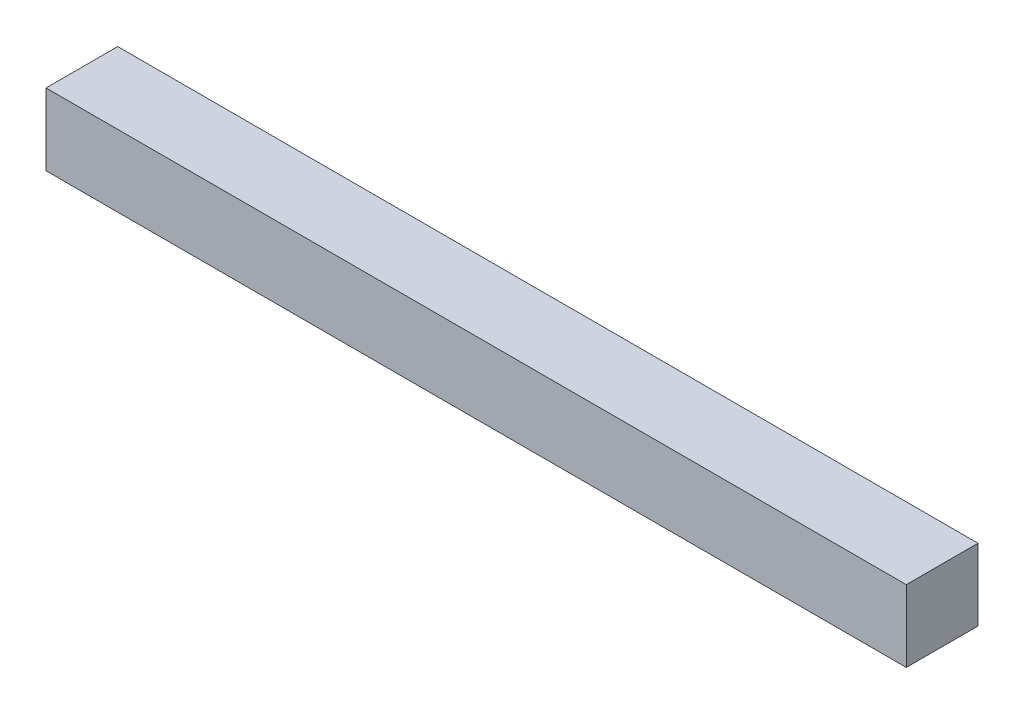
ISO-10303-21;
HEADER;
FILE_DESCRIPTION(('STEP AP214'),'2;1');
FILE_NAME('part.step','',(''),(''),'','','');
FILE_SCHEMA(('AUTOMOTIVE_DESIGN { 1 0 10303 214 1 1 1 1 }'));
ENDSEC;
DATA;
#1=APPLICATION_CONTEXT('core data for automotive mechanical design processes');
#2=APPLICATION_PROTOCOL_DEFINITION('international standard','automotive_design',2000,#1);
#3=PRODUCT_CONTEXT('',#1,'mechanical');
#4=PRODUCT('Part','Part','',(#3));
#5=PRODUCT_RELATED_PRODUCT_CATEGORY('part','',(#4));
#6=PRODUCT_DEFINITION_FORMATION('','',#4);
#7=PRODUCT_DEFINITION_CONTEXT('part definition',#1,'design');
#8=PRODUCT_DEFINITION('design','',#6,#7);
#9=PRODUCT_DEFINITION_SHAPE('','',#8);
#10=(LENGTH_UNIT() NAMED_UNIT(*) SI_UNIT(.MILLI.,.METRE.));
#11=(NAMED_UNIT(*) PLANE_ANGLE_UNIT() SI_UNIT($,.RADIAN.));
#12=(NAMED_UNIT(*) SI_UNIT($,.STERADIAN.) SOLID_ANGLE_UNIT());
#13=UNCERTAINTY_MEASURE_WITH_UNIT(LENGTH_MEASURE(1.E-05),#10,'distance_accuracy_value','');
#14=(GEOMETRIC_REPRESENTATION_CONTEXT(3) GLOBAL_UNCERTAINTY_ASSIGNED_CONTEXT((#13)) GLOBAL_UNIT_ASSIGNED_CONTEXT((#10,
#11,#12)) REPRESENTATION_CONTEXT('',''));
#15=CARTESIAN_POINT('',(0.,0.,0.));
#16=DIRECTION('',(0.,0.,1.));
#17=DIRECTION('',(1.,0.,0.));
#18=AXIS2_PLACEMENT_3D('',#15,#16,#17);
#19=CARTESIAN_POINT('',(1.025,1.65,3.2));
#20=DIRECTION('',(0.,0.,-1.));
#21=DIRECTION('',(-1.,0.,0.));
#22=AXIS2_PLACEMENT_3D('',#19,#20,#21);
#23=PLANE('',#22);
#24=DIRECTION('',(1.,0.,0.));
#25=VECTOR('',#24,1.);
#26=CARTESIAN_POINT('',(2.22473684210527,1.65,3.2));
#27=LINE('',#26,#25);
#28=CARTESIAN_POINT('',(1.025,1.65,3.2));
#29=VERTEX_POINT('',#28);
#30=CARTESIAN_POINT('',(2.22473684210527,1.65,3.2));
#31=VERTEX_POINT('',#30);
#32=EDGE_CURVE('E54',#29,#31,#27,.T.);
#33=ORIENTED_EDGE('',*,*,#32,.T.);
#34=DIRECTION('',(0.,1.,0.));
#35=VECTOR('',#34,1.);
#36=CARTESIAN_POINT('',(2.22473684210527,1.65,3.2));
#37=LINE('',#36,#35);
#38=CARTESIAN_POINT('',(2.22473684210527,1.55,3.2));
#39=VERTEX_POINT('',#38);
#40=EDGE_CURVE('E66',#39,#31,#37,.T.);
#41=ORIENTED_EDGE('',*,*,#40,.F.);
#42=DIRECTION('',(1.,0.,0.));
#43=VECTOR('',#42,1.);
#44=CARTESIAN_POINT('',(2.22473684210527,1.55,3.2));
#45=LINE('',#44,#43);
#46=CARTESIAN_POINT('',(1.025,1.55,3.2));
#47=VERTEX_POINT('',#46);
#48=EDGE_CURVE('E19',#47,#39,#45,.T.);
#49=ORIENTED_EDGE('',*,*,#48,.F.);
#50=DIRECTION('',(0.,1.,0.));
#51=VECTOR('',#50,1.);
#52=CARTESIAN_POINT('',(1.025,1.65,3.2));
#53=LINE('',#52,#51);
#54=EDGE_CURVE('E80',#29,#47,#53,.F.);
#55=ORIENTED_EDGE('',*,*,#54,.F.);
#56=EDGE_LOOP('',(#33,#41,#49,#55));
#57=FACE_BOUND('',#56,.T.);
#58=ADVANCED_FACE('F16',(#57),#23,.T.);
#59=CARTESIAN_POINT('',(2.22473684210527,1.55,3.3));
#60=DIRECTION('',(0.,-1.,0.));
#61=DIRECTION('',(0.,0.,-1.));
#62=AXIS2_PLACEMENT_3D('',#59,#60,#61);
#63=PLANE('',#62);
#64=DIRECTION('',(0.,0.,1.));
#65=VECTOR('',#64,1.);
#66=CARTESIAN_POINT('',(1.025,1.55,3.3));
#67=LINE('',#66,#65);
#68=CARTESIAN_POINT('',(1.025,1.55,3.3));
#69=VERTEX_POINT('',#68);
#70=EDGE_CURVE('E64',#47,#69,#67,.T.);
#71=ORIENTED_EDGE('',*,*,#70,.F.);
#72=ORIENTED_EDGE('',*,*,#48,.T.);
#73=DIRECTION('',(0.,0.,-1.));
#74=VECTOR('',#73,1.);
#75=CARTESIAN_POINT('',(2.22473684210527,1.55,3.2));
#76=LINE('',#75,#74);
#77=CARTESIAN_POINT('',(2.22473684210527,1.55,3.3));
#78=VERTEX_POINT('',#77);
#79=EDGE_CURVE('E61',#78,#39,#76,.T.);
#80=ORIENTED_EDGE('',*,*,#79,.F.);
#81=DIRECTION('',(1.,0.,0.));
#82=VECTOR('',#81,1.);
#83=CARTESIAN_POINT('',(2.22473684210527,1.55,3.3));
#84=LINE('',#83,#82);
#85=EDGE_CURVE('E82',#69,#78,#84,.T.);
#86=ORIENTED_EDGE('',*,*,#85,.F.);
#87=EDGE_LOOP('',(#71,#72,#80,#86));
#88=FACE_BOUND('',#87,.T.);
#89=ADVANCED_FACE('F59',(#88),#63,.T.);
#90=CARTESIAN_POINT('',(2.22473684210527,1.65,3.2));
#91=DIRECTION('',(1.,0.,0.));
#92=DIRECTION('',(0.,0.,-1.));
#93=AXIS2_PLACEMENT_3D('',#90,#91,#92);
#94=PLANE('',#93);
#95=DIRECTION('',(0.,0.,-1.));
#96=VECTOR('',#95,1.);
#97=CARTESIAN_POINT('',(2.22473684210527,1.65,3.3));
#98=LINE('',#97,#96);
#99=CARTESIAN_POINT('',(2.22473684210527,1.65,3.3));
#100=VERTEX_POINT('',#99);
#101=EDGE_CURVE('E76',#31,#100,#98,.F.);
#102=ORIENTED_EDGE('',*,*,#101,.T.);
#103=DIRECTION('',(0.,1.,0.));
#104=VECTOR('',#103,1.);
#105=CARTESIAN_POINT('',(2.22473684210527,1.65,3.3));
#106=LINE('',#105,#104);
#107=EDGE_CURVE('E72',#78,#100,#106,.T.);
#108=ORIENTED_EDGE('',*,*,#107,.F.);
#109=ORIENTED_EDGE('',*,*,#79,.T.);
#110=ORIENTED_EDGE('',*,*,#40,.T.);
#111=EDGE_LOOP('',(#102,#108,#109,#110));
#112=FACE_BOUND('',#111,.T.);
#113=ADVANCED_FACE('F70',(#112),#94,.T.);
#114=CARTESIAN_POINT('',(2.22473684210527,1.65,3.3));
#115=DIRECTION('',(0.,-1.,0.));
#116=DIRECTION('',(0.,0.,-1.));
#117=AXIS2_PLACEMENT_3D('',#114,#115,#116);
#118=PLANE('',#117);
#119=ORIENTED_EDGE('',*,*,#32,.F.);
#120=DIRECTION('',(0.,0.,1.));
#121=VECTOR('',#120,1.);
#122=CARTESIAN_POINT('',(1.025,1.65,3.3));
#123=LINE('',#122,#121);
#124=CARTESIAN_POINT('',(1.025,1.65,3.3));
#125=VERTEX_POINT('',#124);
#126=EDGE_CURVE('E34',#125,#29,#123,.F.);
#127=ORIENTED_EDGE('',*,*,#126,.F.);
#128=DIRECTION('',(1.,0.,0.));
#129=VECTOR('',#128,1.);
#130=CARTESIAN_POINT('',(2.22473684210527,1.65,3.3));
#131=LINE('',#130,#129);
#132=EDGE_CURVE('E25',#100,#125,#131,.F.);
#133=ORIENTED_EDGE('',*,*,#132,.F.);
#134=ORIENTED_EDGE('',*,*,#101,.F.);
#135=EDGE_LOOP('',(#119,#127,#133,#134));
#136=FACE_BOUND('',#135,.T.);
#137=ADVANCED_FACE('F88',(#136),#118,.F.);
#138=CARTESIAN_POINT('',(1.025,1.65,3.3));
#139=DIRECTION('',(-1.,0.,0.));
#140=DIRECTION('',(0.,0.,1.));
#141=AXIS2_PLACEMENT_3D('',#138,#139,#140);
#142=PLANE('',#141);
#143=ORIENTED_EDGE('',*,*,#126,.T.);
#144=ORIENTED_EDGE('',*,*,#54,.T.);
#145=ORIENTED_EDGE('',*,*,#70,.T.);
#146=DIRECTION('',(0.,1.,0.));
#147=VECTOR('',#146,1.);
#148=CARTESIAN_POINT('',(1.025,1.65,3.3));
#149=LINE('',#148,#147);
#150=EDGE_CURVE('E11',#125,#69,#149,.F.);
#151=ORIENTED_EDGE('',*,*,#150,.F.);
#152=EDGE_LOOP('',(#143,#144,#145,#151));
#153=FACE_BOUND('',#152,.T.);
#154=ADVANCED_FACE('F90',(#153),#142,.T.);
#155=CARTESIAN_POINT('',(2.22473684210527,1.65,3.3));
#156=DIRECTION('',(0.,0.,1.));
#157=DIRECTION('',(1.,0.,0.));
#158=AXIS2_PLACEMENT_3D('',#155,#156,#157);
#159=PLANE('',#158);
#160=ORIENTED_EDGE('',*,*,#132,.T.);
#161=ORIENTED_EDGE('',*,*,#150,.T.);
#162=ORIENTED_EDGE('',*,*,#85,.T.);
#163=ORIENTED_EDGE('',*,*,#107,.T.);
#164=EDGE_LOOP('',(#160,#161,#162,#163));
#165=FACE_BOUND('',#164,.T.);
#166=ADVANCED_FACE('F87',(#165),#159,.T.);
#167=CLOSED_SHELL('',(#58,#89,#113,#137,#154,#166));
#168=MANIFOLD_SOLID_BREP('B1',#167);
#169=ADVANCED_BREP_SHAPE_REPRESENTATION('',(#18,#168),#14);
#170=SHAPE_DEFINITION_REPRESENTATION(#9,#169);
ENDSEC;
END-ISO-10303-21;
